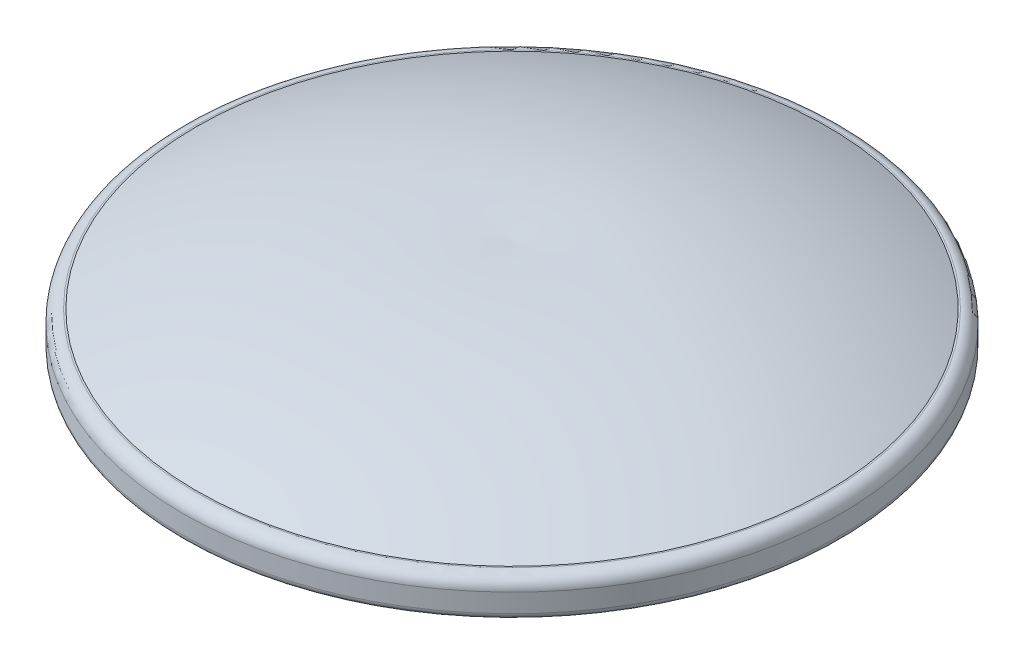
ISO-10303-21;
HEADER;
FILE_DESCRIPTION(('STEP AP214'),'2;1');
FILE_NAME('part.step','',(''),(''),'','','');
FILE_SCHEMA(('AUTOMOTIVE_DESIGN { 1 0 10303 214 1 1 1 1 }'));
ENDSEC;
DATA;
#1=APPLICATION_CONTEXT('core data for automotive mechanical design processes');
#2=APPLICATION_PROTOCOL_DEFINITION('international standard','automotive_design',2000,#1);
#3=PRODUCT_CONTEXT('',#1,'mechanical');
#4=PRODUCT('Part','Part','',(#3));
#5=PRODUCT_RELATED_PRODUCT_CATEGORY('part','',(#4));
#6=PRODUCT_DEFINITION_FORMATION('','',#4);
#7=PRODUCT_DEFINITION_CONTEXT('part definition',#1,'design');
#8=PRODUCT_DEFINITION('design','',#6,#7);
#9=PRODUCT_DEFINITION_SHAPE('','',#8);
#10=(LENGTH_UNIT() NAMED_UNIT(*) SI_UNIT(.MILLI.,.METRE.));
#11=(NAMED_UNIT(*) PLANE_ANGLE_UNIT() SI_UNIT($,.RADIAN.));
#12=(NAMED_UNIT(*) SI_UNIT($,.STERADIAN.) SOLID_ANGLE_UNIT());
#13=UNCERTAINTY_MEASURE_WITH_UNIT(LENGTH_MEASURE(1.E-05),#10,'distance_accuracy_value','');
#14=(GEOMETRIC_REPRESENTATION_CONTEXT(3) GLOBAL_UNCERTAINTY_ASSIGNED_CONTEXT((#13)) GLOBAL_UNIT_ASSIGNED_CONTEXT((#10,
#11,#12)) REPRESENTATION_CONTEXT('',''));
#15=CARTESIAN_POINT('',(0.,0.,0.));
#16=DIRECTION('',(0.,0.,1.));
#17=DIRECTION('',(1.,0.,0.));
#18=AXIS2_PLACEMENT_3D('',#15,#16,#17);
#19=CARTESIAN_POINT('',(0.,6.,0.));
#20=DIRECTION('',(0.,-1.,0.));
#21=DIRECTION('',(0.,0.,-1.));
#22=AXIS2_PLACEMENT_3D('',#19,#20,#21);
#23=CYLINDRICAL_SURFACE('',#22,53.);
#24=CARTESIAN_POINT('',(0.,1.,0.));
#25=DIRECTION('',(0.,1.,0.));
#26=DIRECTION('',(0.,0.,1.));
#27=AXIS2_PLACEMENT_3D('',#24,#25,#26);
#28=CIRCLE('',#27,53.);
#29=CARTESIAN_POINT('',(0.,1.,53.));
#30=VERTEX_POINT('',#29);
#31=EDGE_CURVE('E44',#30,#30,#28,.T.);
#32=ORIENTED_EDGE('',*,*,#31,.T.);
#33=EDGE_LOOP('',(#32));
#34=FACE_BOUND('',#33,.T.);
#35=CARTESIAN_POINT('',(0.,4.,0.));
#36=DIRECTION('',(0.,1.,0.));
#37=DIRECTION('',(0.,0.,1.));
#38=AXIS2_PLACEMENT_3D('',#35,#36,#37);
#39=CIRCLE('',#38,53.);
#40=CARTESIAN_POINT('',(0.,4.,53.));
#41=VERTEX_POINT('',#40);
#42=EDGE_CURVE('E61',#41,#41,#39,.F.);
#43=ORIENTED_EDGE('',*,*,#42,.T.);
#44=EDGE_LOOP('',(#43));
#45=FACE_BOUND('',#44,.T.);
#46=ADVANCED_FACE('F37',(#34,#45),#23,.T.);
#47=CARTESIAN_POINT('',(0.,6.,0.));
#48=DIRECTION('',(0.,1.,0.));
#49=DIRECTION('',(0.,0.,1.));
#50=AXIS2_PLACEMENT_3D('',#47,#48,#49);
#51=PLANE('',#50);
#52=CARTESIAN_POINT('',(0.,6.,0.));
#53=DIRECTION('',(0.,1.,0.));
#54=DIRECTION('',(0.,0.,1.));
#55=AXIS2_PLACEMENT_3D('',#52,#53,#54);
#56=CIRCLE('',#55,51.);
#57=CARTESIAN_POINT('',(0.,6.,51.));
#58=VERTEX_POINT('',#57);
#59=EDGE_CURVE('E57',#58,#58,#56,.T.);
#60=ORIENTED_EDGE('',*,*,#59,.T.);
#61=EDGE_LOOP('',(#60));
#62=FACE_BOUND('',#61,.T.);
#63=CARTESIAN_POINT('',(0.,5.99999999999996,0.));
#64=DIRECTION('',(0.,1.,0.));
#65=DIRECTION('',(-1.,0.,0.));
#66=AXIS2_PLACEMENT_3D('',#63,#64,#65);
#67=CIRCLE('',#66,50.7386045690694);
#68=CARTESIAN_POINT('',(-50.7386045690694,5.99999999999993,0.));
#69=VERTEX_POINT('',#68);
#70=EDGE_CURVE('E55',#69,#69,#67,.T.);
#71=ORIENTED_EDGE('',*,*,#70,.F.);
#72=EDGE_LOOP('',(#71));
#73=FACE_BOUND('',#72,.T.);
#74=ADVANCED_FACE('F51',(#62,#73),#51,.T.);
#75=CARTESIAN_POINT('',(50.6552414059503,6.00000000000001,-2.90732036784591));
#76=CARTESIAN_POINT('',(27.121551088761,17.4720849474361,-1.55662150054754));
#77=CARTESIAN_POINT('',(0.,15.5150987548562,0.));
#78=B_SPLINE_CURVE_WITH_KNOTS('',2,(#75,#76,#77),.UNSPECIFIED.,.F.,.F.,(3,3),(0.,1.),.UNSPECIFIED.);
#79=CARTESIAN_POINT('',(0.,15.5150987548562,0.));
#80=DIRECTION('',(0.,1.,0.));
#81=AXIS1_PLACEMENT('',#79,#80);
#82=SURFACE_OF_REVOLUTION('',#78,#81);
#83=CARTESIAN_POINT('',(0.,15.5150987548562,0.));
#84=VERTEX_POINT('',#83);
#85=VERTEX_LOOP('',#84);
#86=FACE_BOUND('',#85,.T.);
#87=ORIENTED_EDGE('',*,*,#70,.T.);
#88=EDGE_LOOP('',(#87));
#89=FACE_BOUND('',#88,.T.);
#90=ADVANCED_FACE('F47',(#86,#89),#82,.T.);
#91=CARTESIAN_POINT('',(0.,4.,0.));
#92=DIRECTION('',(0.,1.,0.));
#93=DIRECTION('',(0.,0.,1.));
#94=AXIS2_PLACEMENT_3D('',#91,#92,#93);
#95=TOROIDAL_SURFACE('',#94,51.,2.);
#96=ORIENTED_EDGE('',*,*,#42,.F.);
#97=EDGE_LOOP('',(#96));
#98=FACE_BOUND('',#97,.T.);
#99=ORIENTED_EDGE('',*,*,#59,.F.);
#100=EDGE_LOOP('',(#99));
#101=FACE_BOUND('',#100,.T.);
#102=ADVANCED_FACE('F50',(#98,#101),#95,.T.);
#103=CARTESIAN_POINT('',(0.,1.,0.));
#104=DIRECTION('',(0.,1.,0.));
#105=DIRECTION('',(0.,0.,1.));
#106=AXIS2_PLACEMENT_3D('',#103,#104,#105);
#107=TOROIDAL_SURFACE('',#106,52.,1.);
#108=CARTESIAN_POINT('',(0.,0.,0.));
#109=DIRECTION('',(0.,1.,0.));
#110=DIRECTION('',(0.,0.,1.));
#111=AXIS2_PLACEMENT_3D('',#108,#109,#110);
#112=CIRCLE('',#111,52.);
#113=CARTESIAN_POINT('',(0.,0.,52.));
#114=VERTEX_POINT('',#113);
#115=EDGE_CURVE('E58',#114,#114,#112,.T.);
#116=ORIENTED_EDGE('',*,*,#115,.T.);
#117=EDGE_LOOP('',(#116));
#118=FACE_BOUND('',#117,.T.);
#119=ORIENTED_EDGE('',*,*,#31,.F.);
#120=EDGE_LOOP('',(#119));
#121=FACE_BOUND('',#120,.T.);
#122=ADVANCED_FACE('F39',(#118,#121),#107,.T.);
#123=CARTESIAN_POINT('',(0.,6.,0.));
#124=DIRECTION('',(0.,-1.,0.));
#125=DIRECTION('',(0.,0.,-1.));
#126=AXIS2_PLACEMENT_3D('',#123,#124,#125);
#127=CYLINDRICAL_SURFACE('',#126,52.);
#128=ORIENTED_EDGE('',*,*,#115,.F.);
#129=EDGE_LOOP('',(#128));
#130=FACE_BOUND('',#129,.T.);
#131=CARTESIAN_POINT('',(0.,4.,0.));
#132=DIRECTION('',(0.,-1.,0.));
#133=DIRECTION('',(0.,0.,-1.));
#134=AXIS2_PLACEMENT_3D('',#131,#132,#133);
#135=CIRCLE('',#134,52.);
#136=CARTESIAN_POINT('',(0.,4.,-52.));
#137=VERTEX_POINT('',#136);
#138=EDGE_CURVE('E64',#137,#137,#135,.T.);
#139=ORIENTED_EDGE('',*,*,#138,.F.);
#140=EDGE_LOOP('',(#139));
#141=FACE_BOUND('',#140,.T.);
#142=ADVANCED_FACE('F78',(#130,#141),#127,.F.);
#143=CARTESIAN_POINT('',(0.,5.,0.));
#144=DIRECTION('',(0.,1.,0.));
#145=DIRECTION('',(0.,0.,1.));
#146=AXIS2_PLACEMENT_3D('',#143,#144,#145);
#147=PLANE('',#146);
#148=CARTESIAN_POINT('',(0.,5.,0.));
#149=DIRECTION('',(0.,1.,0.));
#150=DIRECTION('',(0.,0.,1.));
#151=AXIS2_PLACEMENT_3D('',#148,#149,#150);
#152=CIRCLE('',#151,47.9881259923736);
#153=CARTESIAN_POINT('',(0.,5.,47.9881259923736));
#154=VERTEX_POINT('',#153);
#155=EDGE_CURVE('E11',#154,#154,#152,.F.);
#156=ORIENTED_EDGE('',*,*,#155,.F.);
#157=EDGE_LOOP('',(#156));
#158=FACE_BOUND('',#157,.T.);
#159=CARTESIAN_POINT('',(0.,5.,0.));
#160=DIRECTION('',(0.,1.,0.));
#161=DIRECTION('',(0.,0.,1.));
#162=AXIS2_PLACEMENT_3D('',#159,#160,#161);
#163=CIRCLE('',#162,51.);
#164=CARTESIAN_POINT('',(0.,5.,51.));
#165=VERTEX_POINT('',#164);
#166=EDGE_CURVE('E115',#165,#165,#163,.T.);
#167=ORIENTED_EDGE('',*,*,#166,.F.);
#168=EDGE_LOOP('',(#167));
#169=FACE_BOUND('',#168,.T.);
#170=ADVANCED_FACE('F84',(#158,#169),#147,.F.);
#171=CARTESIAN_POINT('',(0.,4.,0.));
#172=DIRECTION('',(0.,1.,0.));
#173=DIRECTION('',(0.,0.,1.));
#174=AXIS2_PLACEMENT_3D('',#171,#172,#173);
#175=TOROIDAL_SURFACE('',#174,51.,1.);
#176=ORIENTED_EDGE('',*,*,#138,.T.);
#177=EDGE_LOOP('',(#176));
#178=FACE_BOUND('',#177,.T.);
#179=ORIENTED_EDGE('',*,*,#166,.T.);
#180=EDGE_LOOP('',(#179));
#181=FACE_BOUND('',#180,.T.);
#182=ADVANCED_FACE('F96',(#178,#181),#175,.F.);
#183=CARTESIAN_POINT('',(0.,4.9,0.));
#184=DIRECTION('',(0.,1.,0.));
#185=DIRECTION('',(0.,0.,1.));
#186=AXIS2_PLACEMENT_3D('',#183,#184,#185);
#187=CYLINDRICAL_SURFACE('',#186,47.9881259923736);
#188=CARTESIAN_POINT('',(0.,4.9,0.));
#189=DIRECTION('',(0.,-1.,0.));
#190=DIRECTION('',(0.,0.,-1.));
#191=AXIS2_PLACEMENT_3D('',#188,#189,#190);
#192=CIRCLE('',#191,47.9881259923736);
#193=CARTESIAN_POINT('',(0.,4.9,-47.9881259923736));
#194=VERTEX_POINT('',#193);
#195=EDGE_CURVE('E114',#194,#194,#192,.T.);
#196=ORIENTED_EDGE('',*,*,#195,.F.);
#197=EDGE_LOOP('',(#196));
#198=FACE_BOUND('',#197,.T.);
#199=ORIENTED_EDGE('',*,*,#155,.T.);
#200=EDGE_LOOP('',(#199));
#201=FACE_BOUND('',#200,.T.);
#202=ADVANCED_FACE('F99',(#198,#201),#187,.T.);
#203=CARTESIAN_POINT('',(0.,4.9,0.));
#204=DIRECTION('',(0.,-1.,0.));
#205=DIRECTION('',(0.,0.,-1.));
#206=AXIS2_PLACEMENT_3D('',#203,#204,#205);
#207=PLANE('',#206);
#208=ORIENTED_EDGE('',*,*,#195,.T.);
#209=EDGE_LOOP('',(#208));
#210=FACE_BOUND('',#209,.T.);
#211=ADVANCED_FACE('F106',(#210),#207,.T.);
#212=CLOSED_SHELL('',(#46,#74,#90,#102,#122,#142,#170,#182,#202,#211));
#213=MANIFOLD_SOLID_BREP('B2',#212);
#214=ADVANCED_BREP_SHAPE_REPRESENTATION('',(#18,#213),#14);
#215=SHAPE_DEFINITION_REPRESENTATION(#9,#214);
ENDSEC;
END-ISO-10303-21;
